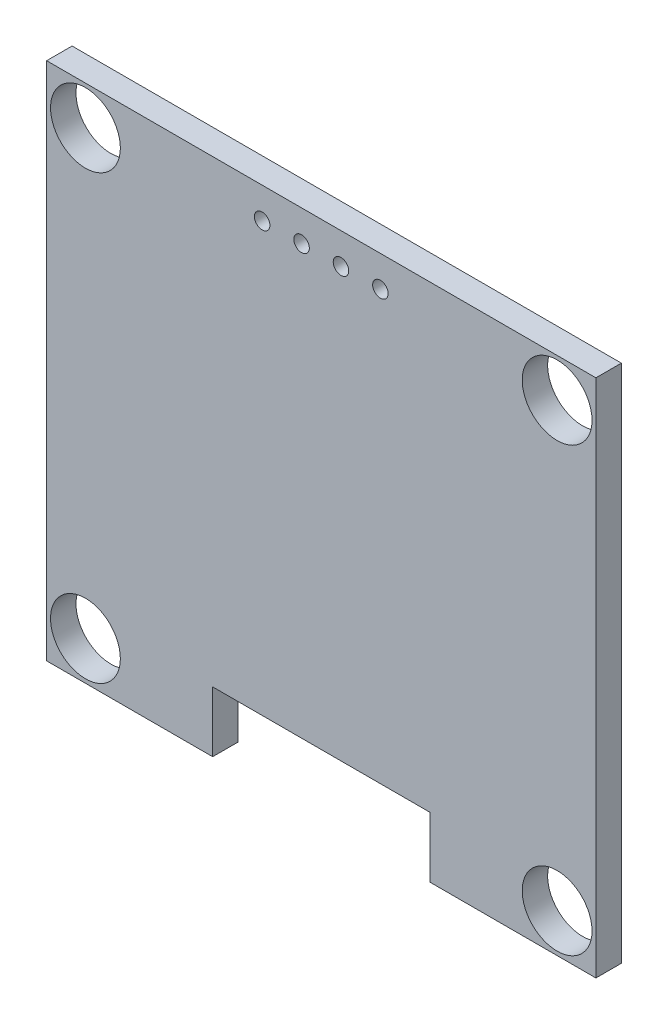
ISO-10303-21;
HEADER;
FILE_DESCRIPTION(('STEP AP214'),'2;1');
FILE_NAME('part.step','',(''),(''),'','','');
FILE_SCHEMA(('AUTOMOTIVE_DESIGN { 1 0 10303 214 1 1 1 1 }'));
ENDSEC;
DATA;
#1=APPLICATION_CONTEXT('core data for automotive mechanical design processes');
#2=APPLICATION_PROTOCOL_DEFINITION('international standard','automotive_design',2000,#1);
#3=PRODUCT_CONTEXT('',#1,'mechanical');
#4=PRODUCT('Part','Part','',(#3));
#5=PRODUCT_RELATED_PRODUCT_CATEGORY('part','',(#4));
#6=PRODUCT_DEFINITION_FORMATION('','',#4);
#7=PRODUCT_DEFINITION_CONTEXT('part definition',#1,'design');
#8=PRODUCT_DEFINITION('design','',#6,#7);
#9=PRODUCT_DEFINITION_SHAPE('','',#8);
#10=(LENGTH_UNIT() NAMED_UNIT(*) SI_UNIT(.MILLI.,.METRE.));
#11=(NAMED_UNIT(*) PLANE_ANGLE_UNIT() SI_UNIT($,.RADIAN.));
#12=(NAMED_UNIT(*) SI_UNIT($,.STERADIAN.) SOLID_ANGLE_UNIT());
#13=UNCERTAINTY_MEASURE_WITH_UNIT(LENGTH_MEASURE(1.E-05),#10,'distance_accuracy_value','');
#14=(GEOMETRIC_REPRESENTATION_CONTEXT(3) GLOBAL_UNCERTAINTY_ASSIGNED_CONTEXT((#13)) GLOBAL_UNIT_ASSIGNED_CONTEXT((#10,
#11,#12)) REPRESENTATION_CONTEXT('',''));
#15=CARTESIAN_POINT('',(0.,0.,0.));
#16=DIRECTION('',(0.,0.,1.));
#17=DIRECTION('',(1.,0.,0.));
#18=AXIS2_PLACEMENT_3D('',#15,#16,#17);
#19=CARTESIAN_POINT('',(-5.35,-33.5,1.64));
#20=DIRECTION('',(0.,-1.,0.));
#21=DIRECTION('',(0.,0.,-1.));
#22=AXIS2_PLACEMENT_3D('',#19,#20,#21);
#23=PLANE('',#22);
#24=DIRECTION('',(-1.,0.,0.));
#25=VECTOR('',#24,1.);
#26=CARTESIAN_POINT('',(-5.35,-33.5,0.));
#27=LINE('',#26,#25);
#28=CARTESIAN_POINT('',(0.,-33.5,0.));
#29=VERTEX_POINT('',#28);
#30=CARTESIAN_POINT('',(-10.7,-33.5,0.));
#31=VERTEX_POINT('',#30);
#32=EDGE_CURVE('E179',#29,#31,#27,.T.);
#33=ORIENTED_EDGE('',*,*,#32,.F.);
#34=DIRECTION('',(0.,0.,-1.));
#35=VECTOR('',#34,1.);
#36=CARTESIAN_POINT('',(0.,-33.5,1.64));
#37=LINE('',#36,#35);
#38=CARTESIAN_POINT('',(0.,-33.5,1.64));
#39=VERTEX_POINT('',#38);
#40=EDGE_CURVE('E11',#39,#29,#37,.T.);
#41=ORIENTED_EDGE('',*,*,#40,.F.);
#42=DIRECTION('',(-1.,0.,0.));
#43=VECTOR('',#42,1.);
#44=CARTESIAN_POINT('',(-5.35,-33.5,1.64));
#45=LINE('',#44,#43);
#46=CARTESIAN_POINT('',(-10.7,-33.5,1.64));
#47=VERTEX_POINT('',#46);
#48=EDGE_CURVE('E139',#39,#47,#45,.T.);
#49=ORIENTED_EDGE('',*,*,#48,.T.);
#50=DIRECTION('',(0.,0.,-1.));
#51=VECTOR('',#50,1.);
#52=CARTESIAN_POINT('',(-10.7,-33.5,1.64));
#53=LINE('',#52,#51);
#54=EDGE_CURVE('E171',#47,#31,#53,.T.);
#55=ORIENTED_EDGE('',*,*,#54,.T.);
#56=EDGE_LOOP('',(#33,#41,#49,#55));
#57=FACE_BOUND('',#56,.T.);
#58=ADVANCED_FACE('F17',(#57),#23,.T.);
#59=CARTESIAN_POINT('',(0.,-16.75,1.64));
#60=DIRECTION('',(1.,0.,0.));
#61=DIRECTION('',(0.,1.,0.));
#62=AXIS2_PLACEMENT_3D('',#59,#60,#61);
#63=PLANE('',#62);
#64=DIRECTION('',(0.,-1.,0.));
#65=VECTOR('',#64,1.);
#66=CARTESIAN_POINT('',(0.,-16.75,0.));
#67=LINE('',#66,#65);
#68=CARTESIAN_POINT('',(0.,0.,0.));
#69=VERTEX_POINT('',#68);
#70=EDGE_CURVE('E235',#69,#29,#67,.T.);
#71=ORIENTED_EDGE('',*,*,#70,.F.);
#72=DIRECTION('',(0.,0.,-1.));
#73=VECTOR('',#72,1.);
#74=CARTESIAN_POINT('',(0.,0.,1.64));
#75=LINE('',#74,#73);
#76=CARTESIAN_POINT('',(0.,0.,1.64));
#77=VERTEX_POINT('',#76);
#78=EDGE_CURVE('E28',#77,#69,#75,.T.);
#79=ORIENTED_EDGE('',*,*,#78,.F.);
#80=DIRECTION('',(0.,-1.,0.));
#81=VECTOR('',#80,1.);
#82=CARTESIAN_POINT('',(0.,-16.75,1.64));
#83=LINE('',#82,#81);
#84=EDGE_CURVE('E136',#77,#39,#83,.T.);
#85=ORIENTED_EDGE('',*,*,#84,.T.);
#86=ORIENTED_EDGE('',*,*,#40,.T.);
#87=EDGE_LOOP('',(#71,#79,#85,#86));
#88=FACE_BOUND('',#87,.T.);
#89=ADVANCED_FACE('F344',(#88),#63,.T.);
#90=CARTESIAN_POINT('',(-17.7,0.,1.64));
#91=DIRECTION('',(0.,-1.,0.));
#92=DIRECTION('',(0.,0.,-1.));
#93=AXIS2_PLACEMENT_3D('',#90,#91,#92);
#94=PLANE('',#93);
#95=DIRECTION('',(-1.,0.,0.));
#96=VECTOR('',#95,1.);
#97=CARTESIAN_POINT('',(-17.7,0.,0.));
#98=LINE('',#97,#96);
#99=CARTESIAN_POINT('',(-35.4,0.,0.));
#100=VERTEX_POINT('',#99);
#101=EDGE_CURVE('E134',#69,#100,#98,.T.);
#102=ORIENTED_EDGE('',*,*,#101,.T.);
#103=DIRECTION('',(0.,0.,-1.));
#104=VECTOR('',#103,1.);
#105=CARTESIAN_POINT('',(-35.4,0.,1.64));
#106=LINE('',#105,#104);
#107=CARTESIAN_POINT('',(-35.4,0.,1.64));
#108=VERTEX_POINT('',#107);
#109=EDGE_CURVE('E183',#108,#100,#106,.T.);
#110=ORIENTED_EDGE('',*,*,#109,.F.);
#111=DIRECTION('',(-1.,0.,0.));
#112=VECTOR('',#111,1.);
#113=CARTESIAN_POINT('',(-17.7,0.,1.64));
#114=LINE('',#113,#112);
#115=EDGE_CURVE('E138',#77,#108,#114,.T.);
#116=ORIENTED_EDGE('',*,*,#115,.F.);
#117=ORIENTED_EDGE('',*,*,#78,.T.);
#118=EDGE_LOOP('',(#102,#110,#116,#117));
#119=FACE_BOUND('',#118,.T.);
#120=ADVANCED_FACE('F268',(#119),#94,.F.);
#121=CARTESIAN_POINT('',(-35.4,-16.75,1.64));
#122=DIRECTION('',(1.,0.,0.));
#123=DIRECTION('',(0.,1.,0.));
#124=AXIS2_PLACEMENT_3D('',#121,#122,#123);
#125=PLANE('',#124);
#126=DIRECTION('',(0.,-1.,0.));
#127=VECTOR('',#126,1.);
#128=CARTESIAN_POINT('',(-35.4,-16.75,0.));
#129=LINE('',#128,#127);
#130=CARTESIAN_POINT('',(-35.4,-33.5,0.));
#131=VERTEX_POINT('',#130);
#132=EDGE_CURVE('E221',#100,#131,#129,.T.);
#133=ORIENTED_EDGE('',*,*,#132,.T.);
#134=DIRECTION('',(0.,0.,-1.));
#135=VECTOR('',#134,1.);
#136=CARTESIAN_POINT('',(-35.4,-33.5,1.64));
#137=LINE('',#136,#135);
#138=CARTESIAN_POINT('',(-35.4,-33.5,1.64));
#139=VERTEX_POINT('',#138);
#140=EDGE_CURVE('E197',#139,#131,#137,.T.);
#141=ORIENTED_EDGE('',*,*,#140,.F.);
#142=DIRECTION('',(0.,-1.,0.));
#143=VECTOR('',#142,1.);
#144=CARTESIAN_POINT('',(-35.4,-16.75,1.64));
#145=LINE('',#144,#143);
#146=EDGE_CURVE('E142',#108,#139,#145,.T.);
#147=ORIENTED_EDGE('',*,*,#146,.F.);
#148=ORIENTED_EDGE('',*,*,#109,.T.);
#149=EDGE_LOOP('',(#133,#141,#147,#148));
#150=FACE_BOUND('',#149,.T.);
#151=ADVANCED_FACE('F360',(#150),#125,.F.);
#152=CARTESIAN_POINT('',(-30.05,-33.5,1.64));
#153=DIRECTION('',(0.,-1.,0.));
#154=DIRECTION('',(0.,0.,-1.));
#155=AXIS2_PLACEMENT_3D('',#152,#153,#154);
#156=PLANE('',#155);
#157=DIRECTION('',(-1.,0.,0.));
#158=VECTOR('',#157,1.);
#159=CARTESIAN_POINT('',(-30.05,-33.5,0.));
#160=LINE('',#159,#158);
#161=CARTESIAN_POINT('',(-24.7,-33.5,0.));
#162=VERTEX_POINT('',#161);
#163=EDGE_CURVE('E193',#162,#131,#160,.T.);
#164=ORIENTED_EDGE('',*,*,#163,.F.);
#165=DIRECTION('',(0.,0.,-1.));
#166=VECTOR('',#165,1.);
#167=CARTESIAN_POINT('',(-24.7,-33.5,1.64));
#168=LINE('',#167,#166);
#169=CARTESIAN_POINT('',(-24.7,-33.5,1.64));
#170=VERTEX_POINT('',#169);
#171=EDGE_CURVE('E233',#170,#162,#168,.T.);
#172=ORIENTED_EDGE('',*,*,#171,.F.);
#173=DIRECTION('',(-1.,0.,0.));
#174=VECTOR('',#173,1.);
#175=CARTESIAN_POINT('',(-30.05,-33.5,1.64));
#176=LINE('',#175,#174);
#177=EDGE_CURVE('E151',#170,#139,#176,.T.);
#178=ORIENTED_EDGE('',*,*,#177,.T.);
#179=ORIENTED_EDGE('',*,*,#140,.T.);
#180=EDGE_LOOP('',(#164,#172,#178,#179));
#181=FACE_BOUND('',#180,.T.);
#182=ADVANCED_FACE('F277',(#181),#156,.T.);
#183=CARTESIAN_POINT('',(-24.7,-31.55,1.64));
#184=DIRECTION('',(-1.,0.,0.));
#185=DIRECTION('',(0.,0.,1.));
#186=AXIS2_PLACEMENT_3D('',#183,#184,#185);
#187=PLANE('',#186);
#188=DIRECTION('',(0.,1.,0.));
#189=VECTOR('',#188,1.);
#190=CARTESIAN_POINT('',(-24.7,-31.55,0.));
#191=LINE('',#190,#189);
#192=CARTESIAN_POINT('',(-24.7,-29.6,0.));
#193=VERTEX_POINT('',#192);
#194=EDGE_CURVE('E189',#162,#193,#191,.T.);
#195=ORIENTED_EDGE('',*,*,#194,.T.);
#196=DIRECTION('',(0.,0.,-1.));
#197=VECTOR('',#196,1.);
#198=CARTESIAN_POINT('',(-24.7,-29.6,1.64));
#199=LINE('',#198,#197);
#200=CARTESIAN_POINT('',(-24.7,-29.6,1.64));
#201=VERTEX_POINT('',#200);
#202=EDGE_CURVE('E169',#201,#193,#199,.T.);
#203=ORIENTED_EDGE('',*,*,#202,.F.);
#204=DIRECTION('',(0.,1.,0.));
#205=VECTOR('',#204,1.);
#206=CARTESIAN_POINT('',(-24.7,-31.55,1.64));
#207=LINE('',#206,#205);
#208=EDGE_CURVE('E160',#170,#201,#207,.T.);
#209=ORIENTED_EDGE('',*,*,#208,.F.);
#210=ORIENTED_EDGE('',*,*,#171,.T.);
#211=EDGE_LOOP('',(#195,#203,#209,#210));
#212=FACE_BOUND('',#211,.T.);
#213=ADVANCED_FACE('F19',(#212),#187,.F.);
#214=CARTESIAN_POINT('',(-2.5,-31.,1.64));
#215=DIRECTION('',(0.,0.,1.));
#216=DIRECTION('',(-1.,0.,0.));
#217=AXIS2_PLACEMENT_3D('',#214,#215,#216);
#218=CYLINDRICAL_SURFACE('',#217,2.25);
#219=CARTESIAN_POINT('',(-2.5,-31.,1.64));
#220=DIRECTION('',(0.,0.,1.));
#221=DIRECTION('',(1.,0.,0.));
#222=AXIS2_PLACEMENT_3D('',#219,#220,#221);
#223=CIRCLE('',#222,2.25);
#224=CARTESIAN_POINT('',(-0.25,-31.,1.64));
#225=VERTEX_POINT('',#224);
#226=EDGE_CURVE('E204',#225,#225,#223,.T.);
#227=ORIENTED_EDGE('',*,*,#226,.T.);
#228=EDGE_LOOP('',(#227));
#229=FACE_BOUND('',#228,.T.);
#230=CARTESIAN_POINT('',(-2.5,-31.,0.));
#231=DIRECTION('',(0.,0.,1.));
#232=DIRECTION('',(1.,0.,0.));
#233=AXIS2_PLACEMENT_3D('',#230,#231,#232);
#234=CIRCLE('',#233,2.25);
#235=CARTESIAN_POINT('',(-0.25,-31.,0.));
#236=VERTEX_POINT('',#235);
#237=EDGE_CURVE('E178',#236,#236,#234,.T.);
#238=ORIENTED_EDGE('',*,*,#237,.F.);
#239=EDGE_LOOP('',(#238));
#240=FACE_BOUND('',#239,.T.);
#241=ADVANCED_FACE('F375',(#229,#240),#218,.F.);
#242=CARTESIAN_POINT('',(-32.9,-31.,1.64));
#243=DIRECTION('',(0.,0.,1.));
#244=DIRECTION('',(-1.,0.,0.));
#245=AXIS2_PLACEMENT_3D('',#242,#243,#244);
#246=CYLINDRICAL_SURFACE('',#245,2.25);
#247=CARTESIAN_POINT('',(-32.9,-31.,1.64));
#248=DIRECTION('',(0.,0.,1.));
#249=DIRECTION('',(1.,0.,0.));
#250=AXIS2_PLACEMENT_3D('',#247,#248,#249);
#251=CIRCLE('',#250,2.25);
#252=CARTESIAN_POINT('',(-30.65,-31.,1.64));
#253=VERTEX_POINT('',#252);
#254=EDGE_CURVE('E246',#253,#253,#251,.T.);
#255=ORIENTED_EDGE('',*,*,#254,.T.);
#256=EDGE_LOOP('',(#255));
#257=FACE_BOUND('',#256,.T.);
#258=CARTESIAN_POINT('',(-32.9,-31.,0.));
#259=DIRECTION('',(0.,0.,1.));
#260=DIRECTION('',(1.,0.,0.));
#261=AXIS2_PLACEMENT_3D('',#258,#259,#260);
#262=CIRCLE('',#261,2.25);
#263=CARTESIAN_POINT('',(-30.65,-31.,0.));
#264=VERTEX_POINT('',#263);
#265=EDGE_CURVE('E21',#264,#264,#262,.T.);
#266=ORIENTED_EDGE('',*,*,#265,.F.);
#267=EDGE_LOOP('',(#266));
#268=FACE_BOUND('',#267,.T.);
#269=ADVANCED_FACE('F367',(#257,#268),#246,.F.);
#270=CARTESIAN_POINT('',(-32.9,-2.5,1.64));
#271=DIRECTION('',(0.,0.,1.));
#272=DIRECTION('',(-1.,0.,0.));
#273=AXIS2_PLACEMENT_3D('',#270,#271,#272);
#274=CYLINDRICAL_SURFACE('',#273,2.25);
#275=CARTESIAN_POINT('',(-32.9,-2.5,1.64));
#276=DIRECTION('',(0.,0.,1.));
#277=DIRECTION('',(1.,0.,0.));
#278=AXIS2_PLACEMENT_3D('',#275,#276,#277);
#279=CIRCLE('',#278,2.25);
#280=CARTESIAN_POINT('',(-30.65,-2.5,1.64));
#281=VERTEX_POINT('',#280);
#282=EDGE_CURVE('E231',#281,#281,#279,.T.);
#283=ORIENTED_EDGE('',*,*,#282,.T.);
#284=EDGE_LOOP('',(#283));
#285=FACE_BOUND('',#284,.T.);
#286=CARTESIAN_POINT('',(-32.9,-2.5,0.));
#287=DIRECTION('',(0.,0.,1.));
#288=DIRECTION('',(1.,0.,0.));
#289=AXIS2_PLACEMENT_3D('',#286,#287,#288);
#290=CIRCLE('',#289,2.25);
#291=CARTESIAN_POINT('',(-30.65,-2.5,0.));
#292=VERTEX_POINT('',#291);
#293=EDGE_CURVE('E168',#292,#292,#290,.T.);
#294=ORIENTED_EDGE('',*,*,#293,.F.);
#295=EDGE_LOOP('',(#294));
#296=FACE_BOUND('',#295,.T.);
#297=ADVANCED_FACE('F364',(#285,#296),#274,.F.);
#298=CARTESIAN_POINT('',(-2.5,-2.5,1.64));
#299=DIRECTION('',(0.,0.,1.));
#300=DIRECTION('',(-1.,0.,0.));
#301=AXIS2_PLACEMENT_3D('',#298,#299,#300);
#302=CYLINDRICAL_SURFACE('',#301,2.25);
#303=CARTESIAN_POINT('',(-2.5,-2.5,1.64));
#304=DIRECTION('',(0.,0.,1.));
#305=DIRECTION('',(1.,0.,0.));
#306=AXIS2_PLACEMENT_3D('',#303,#304,#305);
#307=CIRCLE('',#306,2.25);
#308=CARTESIAN_POINT('',(-0.25,-2.5,1.64));
#309=VERTEX_POINT('',#308);
#310=EDGE_CURVE('E130',#309,#309,#307,.T.);
#311=ORIENTED_EDGE('',*,*,#310,.T.);
#312=EDGE_LOOP('',(#311));
#313=FACE_BOUND('',#312,.T.);
#314=CARTESIAN_POINT('',(-2.5,-2.5,0.));
#315=DIRECTION('',(0.,0.,1.));
#316=DIRECTION('',(1.,0.,0.));
#317=AXIS2_PLACEMENT_3D('',#314,#315,#316);
#318=CIRCLE('',#317,2.25);
#319=CARTESIAN_POINT('',(-0.25,-2.5,0.));
#320=VERTEX_POINT('',#319);
#321=EDGE_CURVE('E166',#320,#320,#318,.T.);
#322=ORIENTED_EDGE('',*,*,#321,.F.);
#323=EDGE_LOOP('',(#322));
#324=FACE_BOUND('',#323,.T.);
#325=ADVANCED_FACE('F366',(#313,#324),#302,.F.);
#326=CARTESIAN_POINT('',(-16.43,-2.,1.64));
#327=DIRECTION('',(0.,0.,1.));
#328=DIRECTION('',(-1.,0.,0.));
#329=AXIS2_PLACEMENT_3D('',#326,#327,#328);
#330=CYLINDRICAL_SURFACE('',#329,0.5);
#331=CARTESIAN_POINT('',(-16.43,-2.,1.64));
#332=DIRECTION('',(0.,0.,1.));
#333=DIRECTION('',(1.,0.,0.));
#334=AXIS2_PLACEMENT_3D('',#331,#332,#333);
#335=CIRCLE('',#334,0.5);
#336=CARTESIAN_POINT('',(-15.93,-2.,1.64));
#337=VERTEX_POINT('',#336);
#338=EDGE_CURVE('E121',#337,#337,#335,.T.);
#339=ORIENTED_EDGE('',*,*,#338,.T.);
#340=EDGE_LOOP('',(#339));
#341=FACE_BOUND('',#340,.T.);
#342=CARTESIAN_POINT('',(-16.43,-2.,0.));
#343=DIRECTION('',(0.,0.,1.));
#344=DIRECTION('',(1.,0.,0.));
#345=AXIS2_PLACEMENT_3D('',#342,#343,#344);
#346=CIRCLE('',#345,0.5);
#347=CARTESIAN_POINT('',(-15.93,-2.,0.));
#348=VERTEX_POINT('',#347);
#349=EDGE_CURVE('E164',#348,#348,#346,.T.);
#350=ORIENTED_EDGE('',*,*,#349,.F.);
#351=EDGE_LOOP('',(#350));
#352=FACE_BOUND('',#351,.T.);
#353=ADVANCED_FACE('F372',(#341,#352),#330,.F.);
#354=CARTESIAN_POINT('',(-18.97,-2.,1.64));
#355=DIRECTION('',(0.,0.,1.));
#356=DIRECTION('',(-1.,0.,0.));
#357=AXIS2_PLACEMENT_3D('',#354,#355,#356);
#358=CYLINDRICAL_SURFACE('',#357,0.5);
#359=CARTESIAN_POINT('',(-18.97,-2.,1.64));
#360=DIRECTION('',(0.,0.,1.));
#361=DIRECTION('',(1.,0.,0.));
#362=AXIS2_PLACEMENT_3D('',#359,#360,#361);
#363=CIRCLE('',#362,0.5);
#364=CARTESIAN_POINT('',(-18.47,-2.,1.64));
#365=VERTEX_POINT('',#364);
#366=EDGE_CURVE('E115',#365,#365,#363,.T.);
#367=ORIENTED_EDGE('',*,*,#366,.T.);
#368=EDGE_LOOP('',(#367));
#369=FACE_BOUND('',#368,.T.);
#370=CARTESIAN_POINT('',(-18.97,-2.,0.));
#371=DIRECTION('',(0.,0.,1.));
#372=DIRECTION('',(1.,0.,0.));
#373=AXIS2_PLACEMENT_3D('',#370,#371,#372);
#374=CIRCLE('',#373,0.5);
#375=CARTESIAN_POINT('',(-18.47,-2.,0.));
#376=VERTEX_POINT('',#375);
#377=EDGE_CURVE('E198',#376,#376,#374,.T.);
#378=ORIENTED_EDGE('',*,*,#377,.F.);
#379=EDGE_LOOP('',(#378));
#380=FACE_BOUND('',#379,.T.);
#381=ADVANCED_FACE('F116',(#369,#380),#358,.F.);
#382=CARTESIAN_POINT('',(-21.51,-2.,1.64));
#383=DIRECTION('',(0.,0.,1.));
#384=DIRECTION('',(-1.,0.,0.));
#385=AXIS2_PLACEMENT_3D('',#382,#383,#384);
#386=CYLINDRICAL_SURFACE('',#385,0.5);
#387=CARTESIAN_POINT('',(-21.51,-2.,1.64));
#388=DIRECTION('',(0.,0.,1.));
#389=DIRECTION('',(1.,0.,0.));
#390=AXIS2_PLACEMENT_3D('',#387,#388,#389);
#391=CIRCLE('',#390,0.5);
#392=CARTESIAN_POINT('',(-21.01,-2.,1.64));
#393=VERTEX_POINT('',#392);
#394=EDGE_CURVE('E120',#393,#393,#391,.T.);
#395=ORIENTED_EDGE('',*,*,#394,.T.);
#396=EDGE_LOOP('',(#395));
#397=FACE_BOUND('',#396,.T.);
#398=CARTESIAN_POINT('',(-21.51,-2.,0.));
#399=DIRECTION('',(0.,0.,1.));
#400=DIRECTION('',(1.,0.,0.));
#401=AXIS2_PLACEMENT_3D('',#398,#399,#400);
#402=CIRCLE('',#401,0.5);
#403=CARTESIAN_POINT('',(-21.01,-2.,0.));
#404=VERTEX_POINT('',#403);
#405=EDGE_CURVE('E40',#404,#404,#402,.T.);
#406=ORIENTED_EDGE('',*,*,#405,.F.);
#407=EDGE_LOOP('',(#406));
#408=FACE_BOUND('',#407,.T.);
#409=ADVANCED_FACE('F362',(#397,#408),#386,.F.);
#410=CARTESIAN_POINT('',(-10.7,-31.55,1.64));
#411=DIRECTION('',(1.,0.,0.));
#412=DIRECTION('',(0.,1.,0.));
#413=AXIS2_PLACEMENT_3D('',#410,#411,#412);
#414=PLANE('',#413);
#415=DIRECTION('',(0.,-1.,0.));
#416=VECTOR('',#415,1.);
#417=CARTESIAN_POINT('',(-10.7,-31.55,0.));
#418=LINE('',#417,#416);
#419=CARTESIAN_POINT('',(-10.7,-29.6,0.));
#420=VERTEX_POINT('',#419);
#421=EDGE_CURVE('E174',#420,#31,#418,.T.);
#422=ORIENTED_EDGE('',*,*,#421,.T.);
#423=ORIENTED_EDGE('',*,*,#54,.F.);
#424=DIRECTION('',(0.,-1.,0.));
#425=VECTOR('',#424,1.);
#426=CARTESIAN_POINT('',(-10.7,-31.55,1.64));
#427=LINE('',#426,#425);
#428=CARTESIAN_POINT('',(-10.7,-29.6,1.64));
#429=VERTEX_POINT('',#428);
#430=EDGE_CURVE('E184',#429,#47,#427,.T.);
#431=ORIENTED_EDGE('',*,*,#430,.F.);
#432=DIRECTION('',(0.,0.,-1.));
#433=VECTOR('',#432,1.);
#434=CARTESIAN_POINT('',(-10.7,-29.6,1.64));
#435=LINE('',#434,#433);
#436=EDGE_CURVE('E172',#429,#420,#435,.T.);
#437=ORIENTED_EDGE('',*,*,#436,.T.);
#438=EDGE_LOOP('',(#422,#423,#431,#437));
#439=FACE_BOUND('',#438,.T.);
#440=ADVANCED_FACE('F356',(#439),#414,.F.);
#441=CARTESIAN_POINT('',(-17.7,-29.6,1.64));
#442=DIRECTION('',(0.,1.,0.));
#443=DIRECTION('',(1.,0.,0.));
#444=AXIS2_PLACEMENT_3D('',#441,#442,#443);
#445=PLANE('',#444);
#446=DIRECTION('',(1.,0.,0.));
#447=VECTOR('',#446,1.);
#448=CARTESIAN_POINT('',(-17.7,-29.6,0.));
#449=LINE('',#448,#447);
#450=EDGE_CURVE('E194',#193,#420,#449,.T.);
#451=ORIENTED_EDGE('',*,*,#450,.T.);
#452=ORIENTED_EDGE('',*,*,#436,.F.);
#453=DIRECTION('',(1.,0.,0.));
#454=VECTOR('',#453,1.);
#455=CARTESIAN_POINT('',(-17.7,-29.6,1.64));
#456=LINE('',#455,#454);
#457=EDGE_CURVE('E188',#201,#429,#456,.T.);
#458=ORIENTED_EDGE('',*,*,#457,.F.);
#459=ORIENTED_EDGE('',*,*,#202,.T.);
#460=EDGE_LOOP('',(#451,#452,#458,#459));
#461=FACE_BOUND('',#460,.T.);
#462=ADVANCED_FACE('F339',(#461),#445,.F.);
#463=CARTESIAN_POINT('',(-17.7,-16.75,0.));
#464=DIRECTION('',(0.,0.,1.));
#465=DIRECTION('',(1.,0.,0.));
#466=AXIS2_PLACEMENT_3D('',#463,#464,#465);
#467=PLANE('',#466);
#468=CARTESIAN_POINT('',(-13.89,-2.,0.));
#469=DIRECTION('',(0.,0.,1.));
#470=DIRECTION('',(1.,0.,0.));
#471=AXIS2_PLACEMENT_3D('',#468,#469,#470);
#472=CIRCLE('',#471,0.5);
#473=CARTESIAN_POINT('',(-13.39,-2.,0.));
#474=VERTEX_POINT('',#473);
#475=EDGE_CURVE('E213',#474,#474,#472,.T.);
#476=ORIENTED_EDGE('',*,*,#475,.T.);
#477=EDGE_LOOP('',(#476));
#478=FACE_BOUND('',#477,.T.);
#479=ORIENTED_EDGE('',*,*,#405,.T.);
#480=EDGE_LOOP('',(#479));
#481=FACE_BOUND('',#480,.T.);
#482=ORIENTED_EDGE('',*,*,#377,.T.);
#483=EDGE_LOOP('',(#482));
#484=FACE_BOUND('',#483,.T.);
#485=ORIENTED_EDGE('',*,*,#349,.T.);
#486=EDGE_LOOP('',(#485));
#487=FACE_BOUND('',#486,.T.);
#488=ORIENTED_EDGE('',*,*,#321,.T.);
#489=EDGE_LOOP('',(#488));
#490=FACE_BOUND('',#489,.T.);
#491=ORIENTED_EDGE('',*,*,#293,.T.);
#492=EDGE_LOOP('',(#491));
#493=FACE_BOUND('',#492,.T.);
#494=ORIENTED_EDGE('',*,*,#265,.T.);
#495=EDGE_LOOP('',(#494));
#496=FACE_BOUND('',#495,.T.);
#497=ORIENTED_EDGE('',*,*,#237,.T.);
#498=EDGE_LOOP('',(#497));
#499=FACE_BOUND('',#498,.T.);
#500=ORIENTED_EDGE('',*,*,#450,.F.);
#501=ORIENTED_EDGE('',*,*,#194,.F.);
#502=ORIENTED_EDGE('',*,*,#163,.T.);
#503=ORIENTED_EDGE('',*,*,#132,.F.);
#504=ORIENTED_EDGE('',*,*,#101,.F.);
#505=ORIENTED_EDGE('',*,*,#70,.T.);
#506=ORIENTED_EDGE('',*,*,#32,.T.);
#507=ORIENTED_EDGE('',*,*,#421,.F.);
#508=EDGE_LOOP('',(#500,#501,#502,#503,#504,#505,#506,#507));
#509=FACE_BOUND('',#508,.T.);
#510=ADVANCED_FACE('F273',(#478,#481,#484,#487,#490,#493,#496,#499,#509),#467,.F.);
#511=CARTESIAN_POINT('',(-13.89,-2.,1.64));
#512=DIRECTION('',(0.,0.,1.));
#513=DIRECTION('',(-1.,0.,0.));
#514=AXIS2_PLACEMENT_3D('',#511,#512,#513);
#515=CYLINDRICAL_SURFACE('',#514,0.5);
#516=CARTESIAN_POINT('',(-13.89,-2.,1.64));
#517=DIRECTION('',(0.,0.,1.));
#518=DIRECTION('',(1.,0.,0.));
#519=AXIS2_PLACEMENT_3D('',#516,#517,#518);
#520=CIRCLE('',#519,0.5);
#521=CARTESIAN_POINT('',(-13.39,-2.,1.64));
#522=VERTEX_POINT('',#521);
#523=EDGE_CURVE('E127',#522,#522,#520,.T.);
#524=ORIENTED_EDGE('',*,*,#523,.T.);
#525=EDGE_LOOP('',(#524));
#526=FACE_BOUND('',#525,.T.);
#527=ORIENTED_EDGE('',*,*,#475,.F.);
#528=EDGE_LOOP('',(#527));
#529=FACE_BOUND('',#528,.T.);
#530=ADVANCED_FACE('F327',(#526,#529),#515,.F.);
#531=CARTESIAN_POINT('',(-17.7,-16.75,1.64));
#532=DIRECTION('',(0.,0.,1.));
#533=DIRECTION('',(1.,0.,0.));
#534=AXIS2_PLACEMENT_3D('',#531,#532,#533);
#535=PLANE('',#534);
#536=ORIENTED_EDGE('',*,*,#523,.F.);
#537=EDGE_LOOP('',(#536));
#538=FACE_BOUND('',#537,.T.);
#539=ORIENTED_EDGE('',*,*,#394,.F.);
#540=EDGE_LOOP('',(#539));
#541=FACE_BOUND('',#540,.T.);
#542=ORIENTED_EDGE('',*,*,#366,.F.);
#543=EDGE_LOOP('',(#542));
#544=FACE_BOUND('',#543,.T.);
#545=ORIENTED_EDGE('',*,*,#338,.F.);
#546=EDGE_LOOP('',(#545));
#547=FACE_BOUND('',#546,.T.);
#548=ORIENTED_EDGE('',*,*,#310,.F.);
#549=EDGE_LOOP('',(#548));
#550=FACE_BOUND('',#549,.T.);
#551=ORIENTED_EDGE('',*,*,#282,.F.);
#552=EDGE_LOOP('',(#551));
#553=FACE_BOUND('',#552,.T.);
#554=ORIENTED_EDGE('',*,*,#254,.F.);
#555=EDGE_LOOP('',(#554));
#556=FACE_BOUND('',#555,.T.);
#557=ORIENTED_EDGE('',*,*,#226,.F.);
#558=EDGE_LOOP('',(#557));
#559=FACE_BOUND('',#558,.T.);
#560=ORIENTED_EDGE('',*,*,#457,.T.);
#561=ORIENTED_EDGE('',*,*,#430,.T.);
#562=ORIENTED_EDGE('',*,*,#48,.F.);
#563=ORIENTED_EDGE('',*,*,#84,.F.);
#564=ORIENTED_EDGE('',*,*,#115,.T.);
#565=ORIENTED_EDGE('',*,*,#146,.T.);
#566=ORIENTED_EDGE('',*,*,#177,.F.);
#567=ORIENTED_EDGE('',*,*,#208,.T.);
#568=EDGE_LOOP('',(#560,#561,#562,#563,#564,#565,#566,#567));
#569=FACE_BOUND('',#568,.T.);
#570=ADVANCED_FACE('F329',(#538,#541,#544,#547,#550,#553,#556,#559,#569),#535,.T.);
#571=CLOSED_SHELL('',(#58,#89,#120,#151,#182,#213,#241,#269,#297,#325,#353,#381,#409,#440,#462,
#510,#530,#570));
#572=MANIFOLD_SOLID_BREP('B1',#571);
#573=ADVANCED_BREP_SHAPE_REPRESENTATION('',(#18,#572),#14);
#574=SHAPE_DEFINITION_REPRESENTATION(#9,#573);
ENDSEC;
END-ISO-10303-21;
